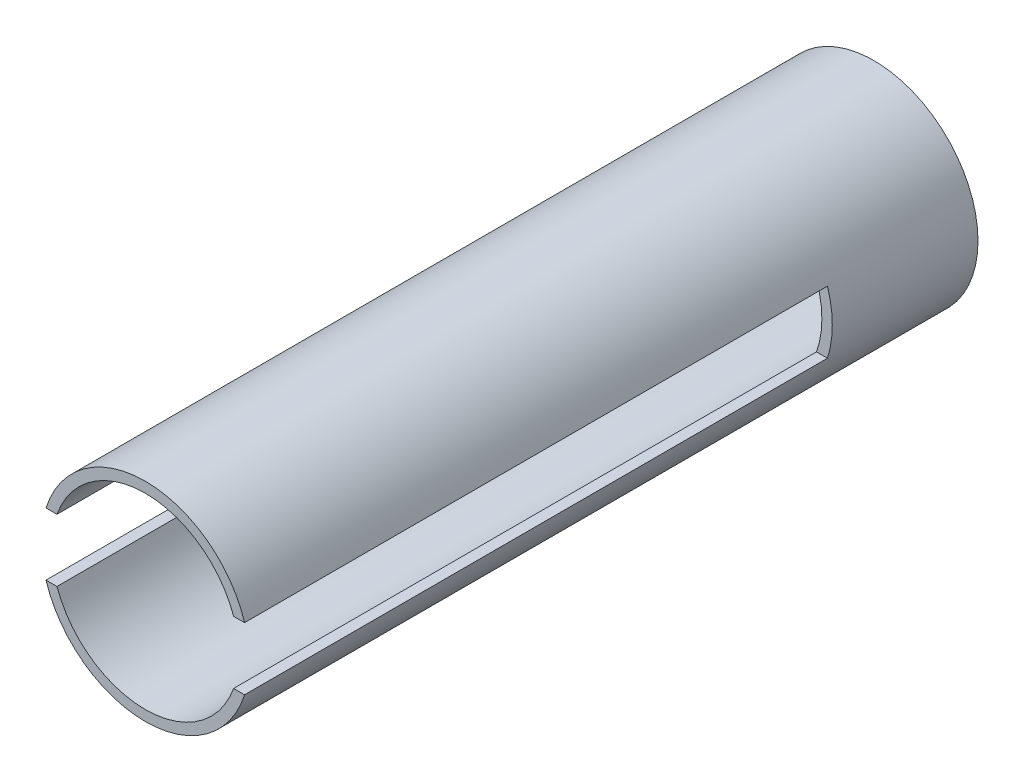
ISO-10303-21;
HEADER;
FILE_DESCRIPTION(('STEP AP214'),'2;1');
FILE_NAME('part.step','',(''),(''),'','','');
FILE_SCHEMA(('AUTOMOTIVE_DESIGN { 1 0 10303 214 1 1 1 1 }'));
ENDSEC;
DATA;
#1=APPLICATION_CONTEXT('core data for automotive mechanical design processes');
#2=APPLICATION_PROTOCOL_DEFINITION('international standard','automotive_design',2000,#1);
#3=PRODUCT_CONTEXT('',#1,'mechanical');
#4=PRODUCT('Part','Part','',(#3));
#5=PRODUCT_RELATED_PRODUCT_CATEGORY('part','',(#4));
#6=PRODUCT_DEFINITION_FORMATION('','',#4);
#7=PRODUCT_DEFINITION_CONTEXT('part definition',#1,'design');
#8=PRODUCT_DEFINITION('design','',#6,#7);
#9=PRODUCT_DEFINITION_SHAPE('','',#8);
#10=(LENGTH_UNIT() NAMED_UNIT(*) SI_UNIT(.MILLI.,.METRE.));
#11=(NAMED_UNIT(*) PLANE_ANGLE_UNIT() SI_UNIT($,.RADIAN.));
#12=(NAMED_UNIT(*) SI_UNIT($,.STERADIAN.) SOLID_ANGLE_UNIT());
#13=UNCERTAINTY_MEASURE_WITH_UNIT(LENGTH_MEASURE(1.E-05),#10,'distance_accuracy_value','');
#14=(GEOMETRIC_REPRESENTATION_CONTEXT(3) GLOBAL_UNCERTAINTY_ASSIGNED_CONTEXT((#13)) GLOBAL_UNIT_ASSIGNED_CONTEXT((#10,
#11,#12)) REPRESENTATION_CONTEXT('',''));
#15=CARTESIAN_POINT('',(0.,0.,0.));
#16=DIRECTION('',(0.,0.,1.));
#17=DIRECTION('',(1.,0.,0.));
#18=AXIS2_PLACEMENT_3D('',#15,#16,#17);
#19=CARTESIAN_POINT('',(0.,0.,-177.8));
#20=DIRECTION('',(0.,0.,-1.));
#21=DIRECTION('',(-1.,0.,0.));
#22=AXIS2_PLACEMENT_3D('',#19,#20,#21);
#23=PLANE('',#22);
#24=CARTESIAN_POINT('',(0.,0.,-177.8));
#25=DIRECTION('',(0.,0.,-1.));
#26=DIRECTION('',(-1.,0.,0.));
#27=AXIS2_PLACEMENT_3D('',#24,#25,#26);
#28=CIRCLE('',#27,63.5);
#29=CARTESIAN_POINT('',(-60.5751392899761,-19.05,-177.8));
#30=VERTEX_POINT('',#29);
#31=CARTESIAN_POINT('',(-60.5751392899761,19.05,-177.8));
#32=VERTEX_POINT('',#31);
#33=EDGE_CURVE('E128',#30,#32,#28,.T.);
#34=ORIENTED_EDGE('',*,*,#33,.F.);
#35=DIRECTION('',(1.,0.,0.));
#36=VECTOR('',#35,1.);
#37=CARTESIAN_POINT('',(0.,-19.05,-177.8));
#38=LINE('',#37,#36);
#39=CARTESIAN_POINT('',(-53.8815367264149,-19.05,-177.8));
#40=VERTEX_POINT('',#39);
#41=EDGE_CURVE('E179',#30,#40,#38,.T.);
#42=ORIENTED_EDGE('',*,*,#41,.T.);
#43=CARTESIAN_POINT('',(0.,0.,-177.8));
#44=DIRECTION('',(0.,0.,-1.));
#45=DIRECTION('',(-1.,0.,0.));
#46=AXIS2_PLACEMENT_3D('',#43,#44,#45);
#47=CIRCLE('',#46,57.15);
#48=CARTESIAN_POINT('',(-53.8815367264149,19.05,-177.8));
#49=VERTEX_POINT('',#48);
#50=EDGE_CURVE('E156',#40,#49,#47,.T.);
#51=ORIENTED_EDGE('',*,*,#50,.T.);
#52=DIRECTION('',(1.,0.,0.));
#53=VECTOR('',#52,1.);
#54=CARTESIAN_POINT('',(0.,19.05,-177.8));
#55=LINE('',#54,#53);
#56=EDGE_CURVE('E117',#32,#49,#55,.T.);
#57=ORIENTED_EDGE('',*,*,#56,.F.);
#58=EDGE_LOOP('',(#34,#42,#51,#57));
#59=FACE_BOUND('',#58,.T.);
#60=ADVANCED_FACE('F43',(#59),#23,.F.);
#61=CARTESIAN_POINT('',(0.,0.,177.8));
#62=DIRECTION('',(0.,0.,-1.));
#63=DIRECTION('',(-1.,0.,0.));
#64=AXIS2_PLACEMENT_3D('',#61,#62,#63);
#65=CYLINDRICAL_SURFACE('',#64,57.15);
#66=DIRECTION('',(0.,0.,-1.));
#67=VECTOR('',#66,1.);
#68=CARTESIAN_POINT('',(-53.8815367264149,19.05,177.8));
#69=LINE('',#68,#67);
#70=CARTESIAN_POINT('',(-53.8815367264149,19.05,177.8));
#71=VERTEX_POINT('',#70);
#72=EDGE_CURVE('E113',#71,#49,#69,.T.);
#73=ORIENTED_EDGE('',*,*,#72,.T.);
#74=ORIENTED_EDGE('',*,*,#50,.F.);
#75=DIRECTION('',(0.,0.,-1.));
#76=VECTOR('',#75,1.);
#77=CARTESIAN_POINT('',(-53.8815367264149,-19.05,177.8));
#78=LINE('',#77,#76);
#79=CARTESIAN_POINT('',(-53.8815367264149,-19.05,177.8));
#80=VERTEX_POINT('',#79);
#81=EDGE_CURVE('E151',#80,#40,#78,.T.);
#82=ORIENTED_EDGE('',*,*,#81,.F.);
#83=CARTESIAN_POINT('',(0.,0.,177.8));
#84=DIRECTION('',(0.,0.,1.));
#85=DIRECTION('',(1.,0.,0.));
#86=AXIS2_PLACEMENT_3D('',#83,#84,#85);
#87=CIRCLE('',#86,57.15);
#88=CARTESIAN_POINT('',(53.8815367264149,-19.05,177.8));
#89=VERTEX_POINT('',#88);
#90=EDGE_CURVE('E154',#80,#89,#87,.T.);
#91=ORIENTED_EDGE('',*,*,#90,.T.);
#92=DIRECTION('',(0.,0.,-1.));
#93=VECTOR('',#92,1.);
#94=CARTESIAN_POINT('',(53.8815367264149,-19.05,177.8));
#95=LINE('',#94,#93);
#96=CARTESIAN_POINT('',(53.8815367264149,-19.05,-177.8));
#97=VERTEX_POINT('',#96);
#98=EDGE_CURVE('E175',#89,#97,#95,.T.);
#99=ORIENTED_EDGE('',*,*,#98,.T.);
#100=CARTESIAN_POINT('',(53.8815367264149,19.05,-177.8));
#101=VERTEX_POINT('',#100);
#102=EDGE_CURVE('E185',#101,#97,#47,.T.);
#103=ORIENTED_EDGE('',*,*,#102,.F.);
#104=DIRECTION('',(0.,0.,-1.));
#105=VECTOR('',#104,1.);
#106=CARTESIAN_POINT('',(53.8815367264149,19.05,177.8));
#107=LINE('',#106,#105);
#108=CARTESIAN_POINT('',(53.8815367264149,19.05,177.8));
#109=VERTEX_POINT('',#108);
#110=EDGE_CURVE('E11',#109,#101,#107,.T.);
#111=ORIENTED_EDGE('',*,*,#110,.F.);
#112=CARTESIAN_POINT('',(0.,0.,177.8));
#113=DIRECTION('',(0.,0.,1.));
#114=DIRECTION('',(1.,0.,0.));
#115=AXIS2_PLACEMENT_3D('',#112,#113,#114);
#116=CIRCLE('',#115,57.15);
#117=EDGE_CURVE('E101',#109,#71,#116,.T.);
#118=ORIENTED_EDGE('',*,*,#117,.T.);
#119=EDGE_LOOP('',(#73,#74,#82,#91,#99,#103,#111,#118));
#120=FACE_BOUND('',#119,.T.);
#121=CARTESIAN_POINT('',(0.,0.,-266.7));
#122=DIRECTION('',(0.,0.,-1.));
#123=DIRECTION('',(-1.,0.,0.));
#124=AXIS2_PLACEMENT_3D('',#121,#122,#123);
#125=CIRCLE('',#124,57.15);
#126=CARTESIAN_POINT('',(-57.15,0.,-266.7));
#127=VERTEX_POINT('',#126);
#128=EDGE_CURVE('E182',#127,#127,#125,.T.);
#129=ORIENTED_EDGE('',*,*,#128,.T.);
#130=EDGE_LOOP('',(#129));
#131=FACE_BOUND('',#130,.T.);
#132=ADVANCED_FACE('F45',(#120,#131),#65,.F.);
#133=CARTESIAN_POINT('',(0.,19.05,177.8));
#134=DIRECTION('',(0.,1.,0.));
#135=DIRECTION('',(0.,0.,1.));
#136=AXIS2_PLACEMENT_3D('',#133,#134,#135);
#137=PLANE('',#136);
#138=CARTESIAN_POINT('',(60.5751392899761,19.05,-177.8));
#139=VERTEX_POINT('',#138);
#140=EDGE_CURVE('E86',#101,#139,#55,.T.);
#141=ORIENTED_EDGE('',*,*,#140,.T.);
#142=DIRECTION('',(0.,0.,-1.));
#143=VECTOR('',#142,1.);
#144=CARTESIAN_POINT('',(60.5751392899761,19.05,177.8));
#145=LINE('',#144,#143);
#146=CARTESIAN_POINT('',(60.5751392899761,19.05,177.8));
#147=VERTEX_POINT('',#146);
#148=EDGE_CURVE('E51',#147,#139,#145,.T.);
#149=ORIENTED_EDGE('',*,*,#148,.F.);
#150=DIRECTION('',(1.,0.,0.));
#151=VECTOR('',#150,1.);
#152=CARTESIAN_POINT('',(0.,19.05,177.8));
#153=LINE('',#152,#151);
#154=EDGE_CURVE('E94',#109,#147,#153,.T.);
#155=ORIENTED_EDGE('',*,*,#154,.F.);
#156=ORIENTED_EDGE('',*,*,#110,.T.);
#157=EDGE_LOOP('',(#141,#149,#155,#156));
#158=FACE_BOUND('',#157,.T.);
#159=ADVANCED_FACE('F105',(#158),#137,.F.);
#160=CARTESIAN_POINT('',(0.,0.,177.8));
#161=DIRECTION('',(0.,0.,-1.));
#162=DIRECTION('',(-1.,0.,0.));
#163=AXIS2_PLACEMENT_3D('',#160,#161,#162);
#164=CYLINDRICAL_SURFACE('',#163,63.5);
#165=ORIENTED_EDGE('',*,*,#148,.T.);
#166=CARTESIAN_POINT('',(60.5751392899761,-19.05,-177.8));
#167=VERTEX_POINT('',#166);
#168=EDGE_CURVE('E79',#139,#167,#28,.T.);
#169=ORIENTED_EDGE('',*,*,#168,.T.);
#170=DIRECTION('',(0.,0.,-1.));
#171=VECTOR('',#170,1.);
#172=CARTESIAN_POINT('',(60.5751392899761,-19.05,177.8));
#173=LINE('',#172,#171);
#174=CARTESIAN_POINT('',(60.5751392899761,-19.05,177.8));
#175=VERTEX_POINT('',#174);
#176=EDGE_CURVE('E58',#175,#167,#173,.T.);
#177=ORIENTED_EDGE('',*,*,#176,.F.);
#178=CARTESIAN_POINT('',(0.,0.,177.8));
#179=DIRECTION('',(0.,0.,1.));
#180=DIRECTION('',(1.,0.,0.));
#181=AXIS2_PLACEMENT_3D('',#178,#179,#180);
#182=CIRCLE('',#181,63.5);
#183=CARTESIAN_POINT('',(-60.5751392899761,-19.05,177.8));
#184=VERTEX_POINT('',#183);
#185=EDGE_CURVE('E172',#184,#175,#182,.T.);
#186=ORIENTED_EDGE('',*,*,#185,.F.);
#187=DIRECTION('',(0.,0.,-1.));
#188=VECTOR('',#187,1.);
#189=CARTESIAN_POINT('',(-60.5751392899761,-19.05,177.8));
#190=LINE('',#189,#188);
#191=EDGE_CURVE('E161',#184,#30,#190,.T.);
#192=ORIENTED_EDGE('',*,*,#191,.T.);
#193=ORIENTED_EDGE('',*,*,#33,.T.);
#194=DIRECTION('',(0.,0.,-1.));
#195=VECTOR('',#194,1.);
#196=CARTESIAN_POINT('',(-60.5751392899761,19.05,177.8));
#197=LINE('',#196,#195);
#198=CARTESIAN_POINT('',(-60.5751392899761,19.05,177.8));
#199=VERTEX_POINT('',#198);
#200=EDGE_CURVE('E107',#199,#32,#197,.T.);
#201=ORIENTED_EDGE('',*,*,#200,.F.);
#202=CARTESIAN_POINT('',(0.,0.,177.8));
#203=DIRECTION('',(0.,0.,1.));
#204=DIRECTION('',(1.,0.,0.));
#205=AXIS2_PLACEMENT_3D('',#202,#203,#204);
#206=CIRCLE('',#205,63.5);
#207=EDGE_CURVE('E98',#147,#199,#206,.T.);
#208=ORIENTED_EDGE('',*,*,#207,.F.);
#209=EDGE_LOOP('',(#165,#169,#177,#186,#192,#193,#201,#208));
#210=FACE_BOUND('',#209,.T.);
#211=CARTESIAN_POINT('',(0.,0.,-266.7));
#212=DIRECTION('',(0.,0.,-1.));
#213=DIRECTION('',(-1.,0.,0.));
#214=AXIS2_PLACEMENT_3D('',#211,#212,#213);
#215=CIRCLE('',#214,63.5);
#216=CARTESIAN_POINT('',(-63.5,0.,-266.7));
#217=VERTEX_POINT('',#216);
#218=EDGE_CURVE('E118',#217,#217,#215,.T.);
#219=ORIENTED_EDGE('',*,*,#218,.F.);
#220=EDGE_LOOP('',(#219));
#221=FACE_BOUND('',#220,.T.);
#222=ADVANCED_FACE('F108',(#210,#221),#164,.T.);
#223=ORIENTED_EDGE('',*,*,#56,.T.);
#224=ORIENTED_EDGE('',*,*,#72,.F.);
#225=EDGE_CURVE('E67',#199,#71,#153,.T.);
#226=ORIENTED_EDGE('',*,*,#225,.F.);
#227=ORIENTED_EDGE('',*,*,#200,.T.);
#228=EDGE_LOOP('',(#223,#224,#226,#227));
#229=FACE_BOUND('',#228,.T.);
#230=ADVANCED_FACE('F123',(#229),#137,.F.);
#231=CARTESIAN_POINT('',(0.,0.,177.8));
#232=DIRECTION('',(0.,0.,1.));
#233=DIRECTION('',(1.,0.,0.));
#234=AXIS2_PLACEMENT_3D('',#231,#232,#233);
#235=PLANE('',#234);
#236=ORIENTED_EDGE('',*,*,#117,.F.);
#237=ORIENTED_EDGE('',*,*,#154,.T.);
#238=ORIENTED_EDGE('',*,*,#207,.T.);
#239=ORIENTED_EDGE('',*,*,#225,.T.);
#240=EDGE_LOOP('',(#236,#237,#238,#239));
#241=FACE_BOUND('',#240,.T.);
#242=ADVANCED_FACE('F96',(#241),#235,.T.);
#243=CARTESIAN_POINT('',(0.,0.,-266.7));
#244=DIRECTION('',(0.,0.,-1.));
#245=DIRECTION('',(-1.,0.,0.));
#246=AXIS2_PLACEMENT_3D('',#243,#244,#245);
#247=PLANE('',#246);
#248=ORIENTED_EDGE('',*,*,#218,.T.);
#249=EDGE_LOOP('',(#248));
#250=FACE_BOUND('',#249,.T.);
#251=ORIENTED_EDGE('',*,*,#128,.F.);
#252=EDGE_LOOP('',(#251));
#253=FACE_BOUND('',#252,.T.);
#254=ADVANCED_FACE('F199',(#250,#253),#247,.T.);
#255=ORIENTED_EDGE('',*,*,#102,.T.);
#256=EDGE_CURVE('E168',#97,#167,#38,.T.);
#257=ORIENTED_EDGE('',*,*,#256,.T.);
#258=ORIENTED_EDGE('',*,*,#168,.F.);
#259=ORIENTED_EDGE('',*,*,#140,.F.);
#260=EDGE_LOOP('',(#255,#257,#258,#259));
#261=FACE_BOUND('',#260,.T.);
#262=ADVANCED_FACE('F189',(#261),#23,.F.);
#263=CARTESIAN_POINT('',(0.,-19.05,177.8));
#264=DIRECTION('',(0.,1.,0.));
#265=DIRECTION('',(0.,0.,1.));
#266=AXIS2_PLACEMENT_3D('',#263,#264,#265);
#267=PLANE('',#266);
#268=ORIENTED_EDGE('',*,*,#41,.F.);
#269=ORIENTED_EDGE('',*,*,#191,.F.);
#270=DIRECTION('',(1.,0.,0.));
#271=VECTOR('',#270,1.);
#272=CARTESIAN_POINT('',(0.,-19.05,177.8));
#273=LINE('',#272,#271);
#274=EDGE_CURVE('E166',#184,#80,#273,.T.);
#275=ORIENTED_EDGE('',*,*,#274,.T.);
#276=ORIENTED_EDGE('',*,*,#81,.T.);
#277=EDGE_LOOP('',(#268,#269,#275,#276));
#278=FACE_BOUND('',#277,.T.);
#279=ADVANCED_FACE('F170',(#278),#267,.T.);
#280=ORIENTED_EDGE('',*,*,#256,.F.);
#281=ORIENTED_EDGE('',*,*,#98,.F.);
#282=EDGE_CURVE('E167',#89,#175,#273,.T.);
#283=ORIENTED_EDGE('',*,*,#282,.T.);
#284=ORIENTED_EDGE('',*,*,#176,.T.);
#285=EDGE_LOOP('',(#280,#281,#283,#284));
#286=FACE_BOUND('',#285,.T.);
#287=ADVANCED_FACE('F204',(#286),#267,.T.);
#288=CARTESIAN_POINT('',(0.,0.,177.8));
#289=DIRECTION('',(0.,0.,1.));
#290=DIRECTION('',(1.,0.,0.));
#291=AXIS2_PLACEMENT_3D('',#288,#289,#290);
#292=PLANE('',#291);
#293=ORIENTED_EDGE('',*,*,#90,.F.);
#294=ORIENTED_EDGE('',*,*,#274,.F.);
#295=ORIENTED_EDGE('',*,*,#185,.T.);
#296=ORIENTED_EDGE('',*,*,#282,.F.);
#297=EDGE_LOOP('',(#293,#294,#295,#296));
#298=FACE_BOUND('',#297,.T.);
#299=ADVANCED_FACE('F165',(#298),#292,.T.);
#300=CLOSED_SHELL('',(#60,#132,#159,#222,#230,#242,#254,#262,#279,#287,#299));
#301=MANIFOLD_SOLID_BREP('B2',#300);
#302=ADVANCED_BREP_SHAPE_REPRESENTATION('',(#18,#301),#14);
#303=SHAPE_DEFINITION_REPRESENTATION(#9,#302);
ENDSEC;
END-ISO-10303-21;
